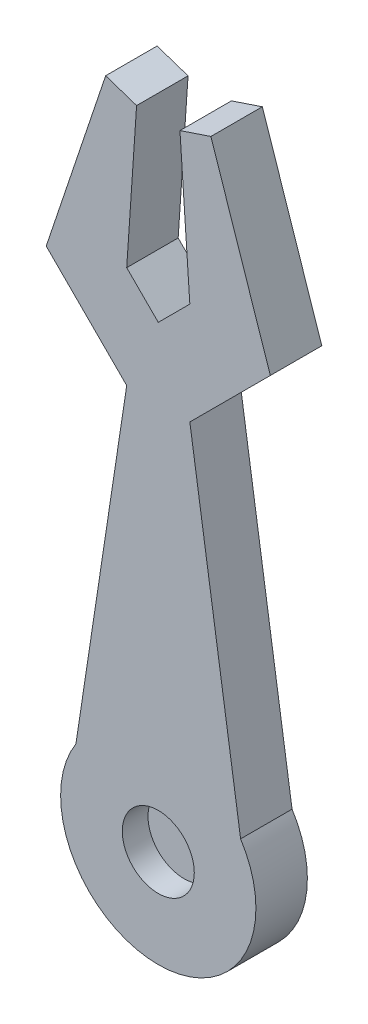
ISO-10303-21;
HEADER;
FILE_DESCRIPTION(('STEP AP214'),'2;1');
FILE_NAME('part.step','',(''),(''),'','','');
FILE_SCHEMA(('AUTOMOTIVE_DESIGN { 1 0 10303 214 1 1 1 1 }'));
ENDSEC;
DATA;
#1=APPLICATION_CONTEXT('core data for automotive mechanical design processes');
#2=APPLICATION_PROTOCOL_DEFINITION('international standard','automotive_design',2000,#1);
#3=PRODUCT_CONTEXT('',#1,'mechanical');
#4=PRODUCT('Part','Part','',(#3));
#5=PRODUCT_RELATED_PRODUCT_CATEGORY('part','',(#4));
#6=PRODUCT_DEFINITION_FORMATION('','',#4);
#7=PRODUCT_DEFINITION_CONTEXT('part definition',#1,'design');
#8=PRODUCT_DEFINITION('design','',#6,#7);
#9=PRODUCT_DEFINITION_SHAPE('','',#8);
#10=(LENGTH_UNIT() NAMED_UNIT(*) SI_UNIT(.MILLI.,.METRE.));
#11=(NAMED_UNIT(*) PLANE_ANGLE_UNIT() SI_UNIT($,.RADIAN.));
#12=(NAMED_UNIT(*) SI_UNIT($,.STERADIAN.) SOLID_ANGLE_UNIT());
#13=UNCERTAINTY_MEASURE_WITH_UNIT(LENGTH_MEASURE(1.E-05),#10,'distance_accuracy_value','');
#14=(GEOMETRIC_REPRESENTATION_CONTEXT(3) GLOBAL_UNCERTAINTY_ASSIGNED_CONTEXT((#13)) GLOBAL_UNIT_ASSIGNED_CONTEXT((#10,
#11,#12)) REPRESENTATION_CONTEXT('',''));
#15=CARTESIAN_POINT('',(0.,0.,0.));
#16=DIRECTION('',(0.,0.,1.));
#17=DIRECTION('',(1.,0.,0.));
#18=AXIS2_PLACEMENT_3D('',#15,#16,#17);
#19=CARTESIAN_POINT('',(0.,0.,10.));
#20=DIRECTION('',(0.988754802294389,-0.149545782086234,0.));
#21=DIRECTION('',(0.149545782086234,0.988754802294389,0.));
#22=AXIS2_PLACEMENT_3D('',#19,#20,#21);
#23=PLANE('',#22);
#24=DIRECTION('',(-0.149545782086234,-0.988754802294389,0.));
#25=VECTOR('',#24,1.);
#26=CARTESIAN_POINT('',(0.,0.,0.));
#27=LINE('',#26,#25);
#28=CARTESIAN_POINT('',(0.,0.,0.));
#29=VERTEX_POINT('',#28);
#30=CARTESIAN_POINT('',(-9.86581469648562,-65.2300019673688,0.));
#31=VERTEX_POINT('',#30);
#32=EDGE_CURVE('E170',#29,#31,#27,.T.);
#33=ORIENTED_EDGE('',*,*,#32,.T.);
#34=DIRECTION('',(0.,0.,-1.));
#35=VECTOR('',#34,1.);
#36=CARTESIAN_POINT('',(-9.86581469648562,-65.2300019673688,10.));
#37=LINE('',#36,#35);
#38=CARTESIAN_POINT('',(-9.86581469648562,-65.2300019673688,10.));
#39=VERTEX_POINT('',#38);
#40=EDGE_CURVE('E11',#39,#31,#37,.T.);
#41=ORIENTED_EDGE('',*,*,#40,.F.);
#42=DIRECTION('',(-0.149545782086234,-0.988754802294389,0.));
#43=VECTOR('',#42,1.);
#44=CARTESIAN_POINT('',(0.,0.,10.));
#45=LINE('',#44,#43);
#46=CARTESIAN_POINT('',(0.,0.,10.));
#47=VERTEX_POINT('',#46);
#48=EDGE_CURVE('E208',#47,#39,#45,.T.);
#49=ORIENTED_EDGE('',*,*,#48,.F.);
#50=DIRECTION('',(0.,0.,-1.));
#51=VECTOR('',#50,1.);
#52=CARTESIAN_POINT('',(0.,0.,10.));
#53=LINE('',#52,#51);
#54=EDGE_CURVE('E166',#47,#29,#53,.T.);
#55=ORIENTED_EDGE('',*,*,#54,.T.);
#56=EDGE_LOOP('',(#33,#41,#49,#55));
#57=FACE_BOUND('',#56,.T.);
#58=ADVANCED_FACE('F39',(#57),#23,.F.);
#59=CARTESIAN_POINT('',(6.13418530351438,-75.4312041368647,10.));
#60=DIRECTION('',(0.,0.,-1.));
#61=DIRECTION('',(-1.,0.,0.));
#62=AXIS2_PLACEMENT_3D('',#59,#60,#61);
#63=CYLINDRICAL_SURFACE('',#62,18.9753662863969);
#64=CARTESIAN_POINT('',(6.13418530351438,-75.4312041368647,0.));
#65=DIRECTION('',(0.,0.,1.));
#66=DIRECTION('',(1.,0.,0.));
#67=AXIS2_PLACEMENT_3D('',#64,#65,#66);
#68=CIRCLE('',#67,18.9753662863969);
#69=CARTESIAN_POINT('',(22.1341853035144,-65.2300019673688,0.));
#70=VERTEX_POINT('',#69);
#71=EDGE_CURVE('E174',#31,#70,#68,.T.);
#72=ORIENTED_EDGE('',*,*,#71,.T.);
#73=DIRECTION('',(0.,0.,-1.));
#74=VECTOR('',#73,1.);
#75=CARTESIAN_POINT('',(22.1341853035144,-65.2300019673688,10.));
#76=LINE('',#75,#74);
#77=CARTESIAN_POINT('',(22.1341853035144,-65.2300019673688,10.));
#78=VERTEX_POINT('',#77);
#79=EDGE_CURVE('E48',#78,#70,#76,.T.);
#80=ORIENTED_EDGE('',*,*,#79,.F.);
#81=CARTESIAN_POINT('',(6.13418530351438,-75.4312041368647,10.));
#82=DIRECTION('',(0.,0.,1.));
#83=DIRECTION('',(1.,0.,0.));
#84=AXIS2_PLACEMENT_3D('',#81,#82,#83);
#85=CIRCLE('',#84,18.9753662863969);
#86=EDGE_CURVE('E114',#39,#78,#85,.T.);
#87=ORIENTED_EDGE('',*,*,#86,.F.);
#88=ORIENTED_EDGE('',*,*,#40,.T.);
#89=EDGE_LOOP('',(#72,#80,#87,#88));
#90=FACE_BOUND('',#89,.T.);
#91=ADVANCED_FACE('F310',(#90),#63,.T.);
#92=CARTESIAN_POINT('',(12.2683706070288,0.,10.));
#93=DIRECTION('',(-0.988754802294389,-0.149545782086234,0.));
#94=DIRECTION('',(0.149545782086234,-0.988754802294389,0.));
#95=AXIS2_PLACEMENT_3D('',#92,#93,#94);
#96=PLANE('',#95);
#97=DIRECTION('',(-0.149545782086234,0.988754802294389,0.));
#98=VECTOR('',#97,1.);
#99=CARTESIAN_POINT('',(12.2683706070288,0.,0.));
#100=LINE('',#99,#98);
#101=CARTESIAN_POINT('',(12.2683706070288,0.,0.));
#102=VERTEX_POINT('',#101);
#103=EDGE_CURVE('E178',#70,#102,#100,.T.);
#104=ORIENTED_EDGE('',*,*,#103,.T.);
#105=DIRECTION('',(0.,0.,-1.));
#106=VECTOR('',#105,1.);
#107=CARTESIAN_POINT('',(12.2683706070288,0.,10.));
#108=LINE('',#107,#106);
#109=CARTESIAN_POINT('',(12.2683706070288,0.,10.));
#110=VERTEX_POINT('',#109);
#111=EDGE_CURVE('E239',#110,#102,#108,.T.);
#112=ORIENTED_EDGE('',*,*,#111,.F.);
#113=DIRECTION('',(-0.149545782086234,0.988754802294389,0.));
#114=VECTOR('',#113,1.);
#115=CARTESIAN_POINT('',(12.2683706070288,0.,10.));
#116=LINE('',#115,#114);
#117=EDGE_CURVE('E249',#78,#110,#116,.T.);
#118=ORIENTED_EDGE('',*,*,#117,.F.);
#119=ORIENTED_EDGE('',*,*,#79,.T.);
#120=EDGE_LOOP('',(#104,#112,#118,#119));
#121=FACE_BOUND('',#120,.T.);
#122=ADVANCED_FACE('F247',(#121),#96,.F.);
#123=CARTESIAN_POINT('',(12.2683706070288,0.,10.));
#124=DIRECTION('',(-0.707106781186544,0.707106781186551,0.));
#125=DIRECTION('',(-0.707106781186551,-0.707106781186544,0.));
#126=AXIS2_PLACEMENT_3D('',#123,#124,#125);
#127=PLANE('',#126);
#128=DIRECTION('',(0.707106781186551,0.707106781186544,0.));
#129=VECTOR('',#128,1.);
#130=CARTESIAN_POINT('',(12.2683706070288,0.,0.));
#131=LINE('',#130,#129);
#132=CARTESIAN_POINT('',(27.9105431309904,15.6421725239615,0.));
#133=VERTEX_POINT('',#132);
#134=EDGE_CURVE('E181',#102,#133,#131,.T.);
#135=ORIENTED_EDGE('',*,*,#134,.T.);
#136=DIRECTION('',(0.,0.,-1.));
#137=VECTOR('',#136,1.);
#138=CARTESIAN_POINT('',(27.9105431309904,15.6421725239615,10.));
#139=LINE('',#138,#137);
#140=CARTESIAN_POINT('',(27.9105431309904,15.6421725239615,10.));
#141=VERTEX_POINT('',#140);
#142=EDGE_CURVE('E235',#141,#133,#139,.T.);
#143=ORIENTED_EDGE('',*,*,#142,.F.);
#144=DIRECTION('',(0.707106781186551,0.707106781186544,0.));
#145=VECTOR('',#144,1.);
#146=CARTESIAN_POINT('',(12.2683706070288,0.,10.));
#147=LINE('',#146,#145);
#148=EDGE_CURVE('E268',#110,#141,#147,.T.);
#149=ORIENTED_EDGE('',*,*,#148,.F.);
#150=ORIENTED_EDGE('',*,*,#111,.T.);
#151=EDGE_LOOP('',(#135,#143,#149,#150));
#152=FACE_BOUND('',#151,.T.);
#153=ADVANCED_FACE('F258',(#152),#127,.F.);
#154=CARTESIAN_POINT('',(27.9105431309904,15.6421725239615,10.));
#155=DIRECTION('',(-0.948119114264583,-0.317915311311271,0.));
#156=DIRECTION('',(0.317915311311271,-0.948119114264583,0.));
#157=AXIS2_PLACEMENT_3D('',#154,#155,#156);
#158=PLANE('',#157);
#159=DIRECTION('',(-0.317915311311271,0.948119114264583,0.));
#160=VECTOR('',#159,1.);
#161=CARTESIAN_POINT('',(27.9105431309904,15.6421725239615,0.));
#162=LINE('',#161,#160);
#163=CARTESIAN_POINT('',(16.3578274760383,50.0958466453672,0.));
#164=VERTEX_POINT('',#163);
#165=EDGE_CURVE('E184',#133,#164,#162,.T.);
#166=ORIENTED_EDGE('',*,*,#165,.T.);
#167=DIRECTION('',(0.,0.,-1.));
#168=VECTOR('',#167,1.);
#169=CARTESIAN_POINT('',(16.3578274760383,50.0958466453672,10.));
#170=LINE('',#169,#168);
#171=CARTESIAN_POINT('',(16.3578274760383,50.0958466453672,10.));
#172=VERTEX_POINT('',#171);
#173=EDGE_CURVE('E231',#172,#164,#170,.T.);
#174=ORIENTED_EDGE('',*,*,#173,.F.);
#175=DIRECTION('',(-0.317915311311271,0.948119114264583,0.));
#176=VECTOR('',#175,1.);
#177=CARTESIAN_POINT('',(27.9105431309904,15.6421725239615,10.));
#178=LINE('',#177,#176);
#179=EDGE_CURVE('E264',#141,#172,#178,.T.);
#180=ORIENTED_EDGE('',*,*,#179,.F.);
#181=ORIENTED_EDGE('',*,*,#142,.T.);
#182=EDGE_LOOP('',(#166,#174,#180,#181));
#183=FACE_BOUND('',#182,.T.);
#184=ADVANCED_FACE('F262',(#183),#158,.F.);
#185=CARTESIAN_POINT('',(16.3578274760383,50.0958466453672,10.));
#186=DIRECTION('',(0.317915311311271,-0.948119114264583,0.));
#187=DIRECTION('',(0.948119114264583,0.317915311311271,0.));
#188=AXIS2_PLACEMENT_3D('',#185,#186,#187);
#189=PLANE('',#188);
#190=DIRECTION('',(-0.948119114264583,-0.317915311311271,0.));
#191=VECTOR('',#190,1.);
#192=CARTESIAN_POINT('',(16.3578274760383,50.0958466453672,0.));
#193=LINE('',#192,#191);
#194=CARTESIAN_POINT('',(10.3462015809611,48.0800789120031,0.));
#195=VERTEX_POINT('',#194);
#196=EDGE_CURVE('E187',#164,#195,#193,.T.);
#197=ORIENTED_EDGE('',*,*,#196,.T.);
#198=DIRECTION('',(0.,0.,-1.));
#199=VECTOR('',#198,1.);
#200=CARTESIAN_POINT('',(10.3462015809611,48.0800789120031,10.));
#201=LINE('',#200,#199);
#202=CARTESIAN_POINT('',(10.3462015809611,48.0800789120031,10.));
#203=VERTEX_POINT('',#202);
#204=EDGE_CURVE('E227',#203,#195,#201,.T.);
#205=ORIENTED_EDGE('',*,*,#204,.F.);
#206=DIRECTION('',(-0.948119114264583,-0.317915311311271,0.));
#207=VECTOR('',#206,1.);
#208=CARTESIAN_POINT('',(16.3578274760383,50.0958466453672,10.));
#209=LINE('',#208,#207);
#210=EDGE_CURVE('E267',#172,#203,#209,.T.);
#211=ORIENTED_EDGE('',*,*,#210,.F.);
#212=ORIENTED_EDGE('',*,*,#173,.T.);
#213=EDGE_LOOP('',(#197,#205,#211,#212));
#214=FACE_BOUND('',#213,.T.);
#215=ADVANCED_FACE('F323',(#214),#189,.F.);
#216=CARTESIAN_POINT('',(10.3462015809611,48.0800789120031,10.));
#217=DIRECTION('',(0.997692575433563,0.0678934821963418,0.));
#218=DIRECTION('',(-0.0678934821963418,0.997692575433563,0.));
#219=AXIS2_PLACEMENT_3D('',#216,#217,#218);
#220=PLANE('',#219);
#221=DIRECTION('',(0.0678934821963418,-0.997692575433562,0.));
#222=VECTOR('',#221,1.);
#223=CARTESIAN_POINT('',(10.3462015809611,48.0800789120031,0.));
#224=LINE('',#223,#222);
#225=CARTESIAN_POINT('',(12.2683706070288,19.8338658146964,0.));
#226=VERTEX_POINT('',#225);
#227=EDGE_CURVE('E190',#195,#226,#224,.T.);
#228=ORIENTED_EDGE('',*,*,#227,.T.);
#229=DIRECTION('',(0.,0.,-1.));
#230=VECTOR('',#229,1.);
#231=CARTESIAN_POINT('',(12.2683706070288,19.8338658146964,10.));
#232=LINE('',#231,#230);
#233=CARTESIAN_POINT('',(12.2683706070288,19.8338658146964,10.));
#234=VERTEX_POINT('',#233);
#235=EDGE_CURVE('E223',#234,#226,#232,.T.);
#236=ORIENTED_EDGE('',*,*,#235,.F.);
#237=DIRECTION('',(0.0678934821963418,-0.997692575433562,0.));
#238=VECTOR('',#237,1.);
#239=CARTESIAN_POINT('',(10.3462015809611,48.0800789120031,10.));
#240=LINE('',#239,#238);
#241=EDGE_CURVE('E272',#203,#234,#240,.T.);
#242=ORIENTED_EDGE('',*,*,#241,.F.);
#243=ORIENTED_EDGE('',*,*,#204,.T.);
#244=EDGE_LOOP('',(#228,#236,#242,#243));
#245=FACE_BOUND('',#244,.T.);
#246=ADVANCED_FACE('F326',(#245),#220,.F.);
#247=CARTESIAN_POINT('',(12.2683706070288,19.8338658146964,10.));
#248=DIRECTION('',(0.707106781186544,-0.707106781186551,0.));
#249=DIRECTION('',(0.707106781186551,0.707106781186544,0.));
#250=AXIS2_PLACEMENT_3D('',#247,#248,#249);
#251=PLANE('',#250);
#252=DIRECTION('',(-0.707106781186551,-0.707106781186544,0.));
#253=VECTOR('',#252,1.);
#254=CARTESIAN_POINT('',(12.2683706070288,19.8338658146964,0.));
#255=LINE('',#254,#253);
#256=CARTESIAN_POINT('',(6.13418530351438,13.6996805111821,0.));
#257=VERTEX_POINT('',#256);
#258=EDGE_CURVE('E193',#226,#257,#255,.T.);
#259=ORIENTED_EDGE('',*,*,#258,.T.);
#260=DIRECTION('',(0.,0.,-1.));
#261=VECTOR('',#260,1.);
#262=CARTESIAN_POINT('',(6.13418530351438,13.6996805111821,10.));
#263=LINE('',#262,#261);
#264=CARTESIAN_POINT('',(6.13418530351438,13.6996805111821,10.));
#265=VERTEX_POINT('',#264);
#266=EDGE_CURVE('E219',#265,#257,#263,.T.);
#267=ORIENTED_EDGE('',*,*,#266,.F.);
#268=DIRECTION('',(-0.707106781186551,-0.707106781186544,0.));
#269=VECTOR('',#268,1.);
#270=CARTESIAN_POINT('',(12.2683706070288,19.8338658146964,10.));
#271=LINE('',#270,#269);
#272=EDGE_CURVE('E279',#234,#265,#271,.T.);
#273=ORIENTED_EDGE('',*,*,#272,.F.);
#274=ORIENTED_EDGE('',*,*,#235,.T.);
#275=EDGE_LOOP('',(#259,#267,#273,#274));
#276=FACE_BOUND('',#275,.T.);
#277=ADVANCED_FACE('F330',(#276),#251,.F.);
#278=CARTESIAN_POINT('',(0.,19.8338658146964,10.));
#279=DIRECTION('',(-0.707106781186544,-0.707106781186551,0.));
#280=DIRECTION('',(0.707106781186551,-0.707106781186544,0.));
#281=AXIS2_PLACEMENT_3D('',#278,#279,#280);
#282=PLANE('',#281);
#283=DIRECTION('',(-0.707106781186551,0.707106781186544,0.));
#284=VECTOR('',#283,1.);
#285=CARTESIAN_POINT('',(0.,19.8338658146964,0.));
#286=LINE('',#285,#284);
#287=CARTESIAN_POINT('',(0.,19.8338658146964,0.));
#288=VERTEX_POINT('',#287);
#289=EDGE_CURVE('E196',#257,#288,#286,.T.);
#290=ORIENTED_EDGE('',*,*,#289,.T.);
#291=DIRECTION('',(0.,0.,-1.));
#292=VECTOR('',#291,1.);
#293=CARTESIAN_POINT('',(0.,19.8338658146964,10.));
#294=LINE('',#293,#292);
#295=CARTESIAN_POINT('',(0.,19.8338658146964,10.));
#296=VERTEX_POINT('',#295);
#297=EDGE_CURVE('E215',#296,#288,#294,.T.);
#298=ORIENTED_EDGE('',*,*,#297,.F.);
#299=DIRECTION('',(-0.707106781186551,0.707106781186544,0.));
#300=VECTOR('',#299,1.);
#301=CARTESIAN_POINT('',(0.,19.8338658146964,10.));
#302=LINE('',#301,#300);
#303=EDGE_CURVE('E282',#265,#296,#302,.T.);
#304=ORIENTED_EDGE('',*,*,#303,.F.);
#305=ORIENTED_EDGE('',*,*,#266,.T.);
#306=EDGE_LOOP('',(#290,#298,#304,#305));
#307=FACE_BOUND('',#306,.T.);
#308=ADVANCED_FACE('F290',(#307),#282,.F.);
#309=CARTESIAN_POINT('',(1.92216902606766,48.0800789120031,10.));
#310=DIRECTION('',(-0.997692575433563,0.0678934821963419,0.));
#311=DIRECTION('',(-0.0678934821963419,-0.997692575433563,0.));
#312=AXIS2_PLACEMENT_3D('',#309,#310,#311);
#313=PLANE('',#312);
#314=DIRECTION('',(0.0678934821963419,0.997692575433562,0.));
#315=VECTOR('',#314,1.);
#316=CARTESIAN_POINT('',(1.92216902606766,48.0800789120031,0.));
#317=LINE('',#316,#315);
#318=CARTESIAN_POINT('',(1.92216902606766,48.0800789120031,0.));
#319=VERTEX_POINT('',#318);
#320=EDGE_CURVE('E199',#288,#319,#317,.T.);
#321=ORIENTED_EDGE('',*,*,#320,.T.);
#322=DIRECTION('',(0.,0.,-1.));
#323=VECTOR('',#322,1.);
#324=CARTESIAN_POINT('',(1.92216902606766,48.0800789120031,10.));
#325=LINE('',#324,#323);
#326=CARTESIAN_POINT('',(1.92216902606766,48.0800789120031,10.));
#327=VERTEX_POINT('',#326);
#328=EDGE_CURVE('E159',#327,#319,#325,.T.);
#329=ORIENTED_EDGE('',*,*,#328,.F.);
#330=DIRECTION('',(0.0678934821963419,0.997692575433562,0.));
#331=VECTOR('',#330,1.);
#332=CARTESIAN_POINT('',(1.92216902606766,48.0800789120031,10.));
#333=LINE('',#332,#331);
#334=EDGE_CURVE('E148',#296,#327,#333,.T.);
#335=ORIENTED_EDGE('',*,*,#334,.F.);
#336=ORIENTED_EDGE('',*,*,#297,.T.);
#337=EDGE_LOOP('',(#321,#329,#335,#336));
#338=FACE_BOUND('',#337,.T.);
#339=ADVANCED_FACE('F294',(#338),#313,.F.);
#340=CARTESIAN_POINT('',(-4.08945686900955,50.0958466453672,10.));
#341=DIRECTION('',(-0.317915311311271,-0.948119114264583,0.));
#342=DIRECTION('',(0.948119114264583,-0.317915311311271,0.));
#343=AXIS2_PLACEMENT_3D('',#340,#341,#342);
#344=PLANE('',#343);
#345=DIRECTION('',(-0.948119114264583,0.317915311311271,0.));
#346=VECTOR('',#345,1.);
#347=CARTESIAN_POINT('',(-4.08945686900955,50.0958466453672,0.));
#348=LINE('',#347,#346);
#349=CARTESIAN_POINT('',(-4.08945686900955,50.0958466453672,0.));
#350=VERTEX_POINT('',#349);
#351=EDGE_CURVE('E157',#319,#350,#348,.T.);
#352=ORIENTED_EDGE('',*,*,#351,.T.);
#353=DIRECTION('',(0.,0.,-1.));
#354=VECTOR('',#353,1.);
#355=CARTESIAN_POINT('',(-4.08945686900955,50.0958466453672,10.));
#356=LINE('',#355,#354);
#357=CARTESIAN_POINT('',(-4.08945686900955,50.0958466453672,10.));
#358=VERTEX_POINT('',#357);
#359=EDGE_CURVE('E154',#358,#350,#356,.T.);
#360=ORIENTED_EDGE('',*,*,#359,.F.);
#361=DIRECTION('',(-0.948119114264583,0.317915311311271,0.));
#362=VECTOR('',#361,1.);
#363=CARTESIAN_POINT('',(-4.08945686900955,50.0958466453672,10.));
#364=LINE('',#363,#362);
#365=EDGE_CURVE('E142',#327,#358,#364,.T.);
#366=ORIENTED_EDGE('',*,*,#365,.F.);
#367=ORIENTED_EDGE('',*,*,#328,.T.);
#368=EDGE_LOOP('',(#352,#360,#366,#367));
#369=FACE_BOUND('',#368,.T.);
#370=ADVANCED_FACE('F155',(#369),#344,.F.);
#371=CARTESIAN_POINT('',(-15.6421725239617,15.6421725239615,10.));
#372=DIRECTION('',(0.948119114264583,-0.317915311311271,0.));
#373=DIRECTION('',(0.317915311311271,0.948119114264583,0.));
#374=AXIS2_PLACEMENT_3D('',#371,#372,#373);
#375=PLANE('',#374);
#376=DIRECTION('',(-0.317915311311271,-0.948119114264583,0.));
#377=VECTOR('',#376,1.);
#378=CARTESIAN_POINT('',(-15.6421725239617,15.6421725239615,0.));
#379=LINE('',#378,#377);
#380=CARTESIAN_POINT('',(-15.6421725239617,15.6421725239615,0.));
#381=VERTEX_POINT('',#380);
#382=EDGE_CURVE('E100',#350,#381,#379,.T.);
#383=ORIENTED_EDGE('',*,*,#382,.T.);
#384=DIRECTION('',(0.,0.,-1.));
#385=VECTOR('',#384,1.);
#386=CARTESIAN_POINT('',(-15.6421725239617,15.6421725239615,10.));
#387=LINE('',#386,#385);
#388=CARTESIAN_POINT('',(-15.6421725239617,15.6421725239615,10.));
#389=VERTEX_POINT('',#388);
#390=EDGE_CURVE('E160',#389,#381,#387,.T.);
#391=ORIENTED_EDGE('',*,*,#390,.F.);
#392=DIRECTION('',(-0.317915311311271,-0.948119114264583,0.));
#393=VECTOR('',#392,1.);
#394=CARTESIAN_POINT('',(-15.6421725239617,15.6421725239615,10.));
#395=LINE('',#394,#393);
#396=EDGE_CURVE('E146',#358,#389,#395,.T.);
#397=ORIENTED_EDGE('',*,*,#396,.F.);
#398=ORIENTED_EDGE('',*,*,#359,.T.);
#399=EDGE_LOOP('',(#383,#391,#397,#398));
#400=FACE_BOUND('',#399,.T.);
#401=ADVANCED_FACE('F162',(#400),#375,.F.);
#402=CARTESIAN_POINT('',(0.,0.,10.));
#403=DIRECTION('',(0.707106781186544,0.707106781186551,0.));
#404=DIRECTION('',(-0.707106781186551,0.707106781186544,0.));
#405=AXIS2_PLACEMENT_3D('',#402,#403,#404);
#406=PLANE('',#405);
#407=DIRECTION('',(0.707106781186551,-0.707106781186544,0.));
#408=VECTOR('',#407,1.);
#409=CARTESIAN_POINT('',(0.,0.,0.));
#410=LINE('',#409,#408);
#411=EDGE_CURVE('E106',#381,#29,#410,.T.);
#412=ORIENTED_EDGE('',*,*,#411,.T.);
#413=ORIENTED_EDGE('',*,*,#54,.F.);
#414=DIRECTION('',(0.707106781186551,-0.707106781186544,0.));
#415=VECTOR('',#414,1.);
#416=CARTESIAN_POINT('',(0.,0.,10.));
#417=LINE('',#416,#415);
#418=EDGE_CURVE('E56',#389,#47,#417,.T.);
#419=ORIENTED_EDGE('',*,*,#418,.F.);
#420=ORIENTED_EDGE('',*,*,#390,.T.);
#421=EDGE_LOOP('',(#412,#413,#419,#420));
#422=FACE_BOUND('',#421,.T.);
#423=ADVANCED_FACE('F298',(#422),#406,.F.);
#424=CARTESIAN_POINT('',(6.13418530351438,-75.4312041368647,10.));
#425=DIRECTION('',(0.,0.,1.));
#426=DIRECTION('',(1.,0.,0.));
#427=AXIS2_PLACEMENT_3D('',#424,#425,#426);
#428=PLANE('',#427);
#429=CARTESIAN_POINT('',(6.13418530351438,-75.4312041368647,10.));
#430=DIRECTION('',(0.,0.,1.));
#431=DIRECTION('',(1.,0.,0.));
#432=AXIS2_PLACEMENT_3D('',#429,#430,#431);
#433=CIRCLE('',#432,7.);
#434=CARTESIAN_POINT('',(13.1341853035144,-75.4312041368647,10.));
#435=VERTEX_POINT('',#434);
#436=EDGE_CURVE('E392',#435,#435,#433,.T.);
#437=ORIENTED_EDGE('',*,*,#436,.F.);
#438=EDGE_LOOP('',(#437));
#439=FACE_BOUND('',#438,.T.);
#440=ORIENTED_EDGE('',*,*,#48,.T.);
#441=ORIENTED_EDGE('',*,*,#86,.T.);
#442=ORIENTED_EDGE('',*,*,#117,.T.);
#443=ORIENTED_EDGE('',*,*,#148,.T.);
#444=ORIENTED_EDGE('',*,*,#179,.T.);
#445=ORIENTED_EDGE('',*,*,#210,.T.);
#446=ORIENTED_EDGE('',*,*,#241,.T.);
#447=ORIENTED_EDGE('',*,*,#272,.T.);
#448=ORIENTED_EDGE('',*,*,#303,.T.);
#449=ORIENTED_EDGE('',*,*,#334,.T.);
#450=ORIENTED_EDGE('',*,*,#365,.T.);
#451=ORIENTED_EDGE('',*,*,#396,.T.);
#452=ORIENTED_EDGE('',*,*,#418,.T.);
#453=EDGE_LOOP('',(#440,#441,#442,#443,#444,#445,#446,#447,#448,#449,#450,#451,#452));
#454=FACE_BOUND('',#453,.T.);
#455=ADVANCED_FACE('F144',(#439,#454),#428,.T.);
#456=CARTESIAN_POINT('',(6.13418530351438,-75.4312041368647,0.));
#457=DIRECTION('',(0.,0.,1.));
#458=DIRECTION('',(1.,0.,0.));
#459=AXIS2_PLACEMENT_3D('',#456,#457,#458);
#460=PLANE('',#459);
#461=ORIENTED_EDGE('',*,*,#32,.F.);
#462=ORIENTED_EDGE('',*,*,#411,.F.);
#463=ORIENTED_EDGE('',*,*,#382,.F.);
#464=ORIENTED_EDGE('',*,*,#351,.F.);
#465=ORIENTED_EDGE('',*,*,#320,.F.);
#466=ORIENTED_EDGE('',*,*,#289,.F.);
#467=ORIENTED_EDGE('',*,*,#258,.F.);
#468=ORIENTED_EDGE('',*,*,#227,.F.);
#469=ORIENTED_EDGE('',*,*,#196,.F.);
#470=ORIENTED_EDGE('',*,*,#165,.F.);
#471=ORIENTED_EDGE('',*,*,#134,.F.);
#472=ORIENTED_EDGE('',*,*,#103,.F.);
#473=ORIENTED_EDGE('',*,*,#71,.F.);
#474=EDGE_LOOP('',(#461,#462,#463,#464,#465,#466,#467,#468,#469,#470,#471,#472,#473));
#475=FACE_BOUND('',#474,.T.);
#476=ADVANCED_FACE('F253',(#475),#460,.F.);
#477=CARTESIAN_POINT('',(6.13418530351438,-75.4312041368647,5.));
#478=DIRECTION('',(0.,0.,1.));
#479=DIRECTION('',(1.,0.,0.));
#480=AXIS2_PLACEMENT_3D('',#477,#478,#479);
#481=CYLINDRICAL_SURFACE('',#480,7.);
#482=CARTESIAN_POINT('',(6.13418530351438,-75.4312041368647,5.));
#483=DIRECTION('',(0.,0.,1.));
#484=DIRECTION('',(1.,0.,0.));
#485=AXIS2_PLACEMENT_3D('',#482,#483,#484);
#486=CIRCLE('',#485,7.);
#487=CARTESIAN_POINT('',(13.1341853035144,-75.4312041368647,5.));
#488=VERTEX_POINT('',#487);
#489=EDGE_CURVE('E175',#488,#488,#486,.T.);
#490=ORIENTED_EDGE('',*,*,#489,.F.);
#491=EDGE_LOOP('',(#490));
#492=FACE_BOUND('',#491,.T.);
#493=ORIENTED_EDGE('',*,*,#436,.T.);
#494=EDGE_LOOP('',(#493));
#495=FACE_BOUND('',#494,.T.);
#496=ADVANCED_FACE('F362',(#492,#495),#481,.F.);
#497=CARTESIAN_POINT('',(6.13418530351438,-75.4312041368647,5.));
#498=DIRECTION('',(0.,0.,1.));
#499=DIRECTION('',(1.,0.,0.));
#500=AXIS2_PLACEMENT_3D('',#497,#498,#499);
#501=PLANE('',#500);
#502=ORIENTED_EDGE('',*,*,#489,.T.);
#503=EDGE_LOOP('',(#502));
#504=FACE_BOUND('',#503,.T.);
#505=ADVANCED_FACE('F375',(#504),#501,.T.);
#506=CLOSED_SHELL('',(#58,#91,#122,#153,#184,#215,#246,#277,#308,#339,#370,#401,#423,#455,#476,
#496,#505));
#507=MANIFOLD_SOLID_BREP('B2',#506);
#508=ADVANCED_BREP_SHAPE_REPRESENTATION('',(#18,#507),#14);
#509=SHAPE_DEFINITION_REPRESENTATION(#9,#508);
ENDSEC;
END-ISO-10303-21;
